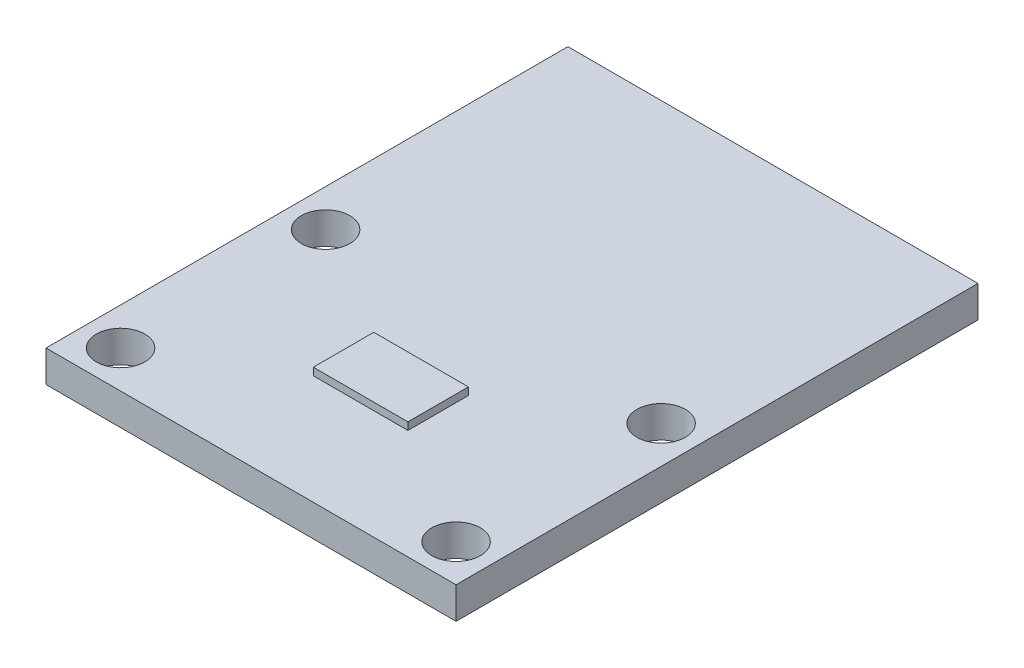
ISO-10303-21;
HEADER;
FILE_DESCRIPTION(('STEP AP214'),'2;1');
FILE_NAME('part.step','',(''),(''),'','','');
FILE_SCHEMA(('AUTOMOTIVE_DESIGN { 1 0 10303 214 1 1 1 1 }'));
ENDSEC;
DATA;
#1=APPLICATION_CONTEXT('core data for automotive mechanical design processes');
#2=APPLICATION_PROTOCOL_DEFINITION('international standard','automotive_design',2000,#1);
#3=PRODUCT_CONTEXT('',#1,'mechanical');
#4=PRODUCT('Part','Part','',(#3));
#5=PRODUCT_RELATED_PRODUCT_CATEGORY('part','',(#4));
#6=PRODUCT_DEFINITION_FORMATION('','',#4);
#7=PRODUCT_DEFINITION_CONTEXT('part definition',#1,'design');
#8=PRODUCT_DEFINITION('design','',#6,#7);
#9=PRODUCT_DEFINITION_SHAPE('','',#8);
#10=(LENGTH_UNIT() NAMED_UNIT(*) SI_UNIT(.MILLI.,.METRE.));
#11=(NAMED_UNIT(*) PLANE_ANGLE_UNIT() SI_UNIT($,.RADIAN.));
#12=(NAMED_UNIT(*) SI_UNIT($,.STERADIAN.) SOLID_ANGLE_UNIT());
#13=UNCERTAINTY_MEASURE_WITH_UNIT(LENGTH_MEASURE(1.E-05),#10,'distance_accuracy_value','');
#14=(GEOMETRIC_REPRESENTATION_CONTEXT(3) GLOBAL_UNCERTAINTY_ASSIGNED_CONTEXT((#13)) GLOBAL_UNIT_ASSIGNED_CONTEXT((#10,
#11,#12)) REPRESENTATION_CONTEXT('',''));
#15=CARTESIAN_POINT('',(0.,0.,0.));
#16=DIRECTION('',(0.,0.,1.));
#17=DIRECTION('',(1.,0.,0.));
#18=AXIS2_PLACEMENT_3D('',#15,#16,#17);
#19=CARTESIAN_POINT('',(0.,1.7,0.));
#20=DIRECTION('',(0.,-1.,0.));
#21=DIRECTION('',(0.,0.,-1.));
#22=AXIS2_PLACEMENT_3D('',#19,#20,#21);
#23=PLANE('',#22);
#24=CARTESIAN_POINT('',(-9.,1.7,12.));
#25=DIRECTION('',(0.,1.,0.));
#26=DIRECTION('',(0.,0.,1.));
#27=AXIS2_PLACEMENT_3D('',#24,#25,#26);
#28=CIRCLE('',#27,1.3);
#29=CARTESIAN_POINT('',(-9.,1.7,13.3));
#30=VERTEX_POINT('',#29);
#31=EDGE_CURVE('E126',#30,#30,#28,.T.);
#32=ORIENTED_EDGE('',*,*,#31,.F.);
#33=EDGE_LOOP('',(#32));
#34=FACE_BOUND('',#33,.T.);
#35=CARTESIAN_POINT('',(-9.,1.7,0.999999999999994));
#36=DIRECTION('',(0.,1.,0.));
#37=DIRECTION('',(0.,0.,1.));
#38=AXIS2_PLACEMENT_3D('',#35,#36,#37);
#39=CIRCLE('',#38,1.3);
#40=CARTESIAN_POINT('',(-9.,1.7,2.3));
#41=VERTEX_POINT('',#40);
#42=EDGE_CURVE('E135',#41,#41,#39,.T.);
#43=ORIENTED_EDGE('',*,*,#42,.F.);
#44=EDGE_LOOP('',(#43));
#45=FACE_BOUND('',#44,.T.);
#46=CARTESIAN_POINT('',(9.,1.7,12.));
#47=DIRECTION('',(0.,1.,0.));
#48=DIRECTION('',(0.,0.,1.));
#49=AXIS2_PLACEMENT_3D('',#46,#47,#48);
#50=CIRCLE('',#49,1.3);
#51=CARTESIAN_POINT('',(9.,1.7,13.3));
#52=VERTEX_POINT('',#51);
#53=EDGE_CURVE('E141',#52,#52,#50,.T.);
#54=ORIENTED_EDGE('',*,*,#53,.F.);
#55=EDGE_LOOP('',(#54));
#56=FACE_BOUND('',#55,.T.);
#57=CARTESIAN_POINT('',(9.,1.7,0.999999999999994));
#58=DIRECTION('',(0.,1.,0.));
#59=DIRECTION('',(0.,0.,1.));
#60=AXIS2_PLACEMENT_3D('',#57,#58,#59);
#61=CIRCLE('',#60,1.3);
#62=CARTESIAN_POINT('',(9.,1.7,2.3));
#63=VERTEX_POINT('',#62);
#64=EDGE_CURVE('E147',#63,#63,#61,.T.);
#65=ORIENTED_EDGE('',*,*,#64,.F.);
#66=EDGE_LOOP('',(#65));
#67=FACE_BOUND('',#66,.T.);
#68=DIRECTION('',(0.,0.,-1.));
#69=VECTOR('',#68,1.);
#70=CARTESIAN_POINT('',(11.,1.7,14.));
#71=LINE('',#70,#69);
#72=CARTESIAN_POINT('',(11.,1.7,14.));
#73=VERTEX_POINT('',#72);
#74=CARTESIAN_POINT('',(11.,1.7,-14.));
#75=VERTEX_POINT('',#74);
#76=EDGE_CURVE('E153',#73,#75,#71,.T.);
#77=ORIENTED_EDGE('',*,*,#76,.T.);
#78=DIRECTION('',(-1.,0.,0.));
#79=VECTOR('',#78,1.);
#80=CARTESIAN_POINT('',(-11.,1.7,-14.));
#81=LINE('',#80,#79);
#82=CARTESIAN_POINT('',(-11.,1.7,-14.));
#83=VERTEX_POINT('',#82);
#84=EDGE_CURVE('E156',#75,#83,#81,.T.);
#85=ORIENTED_EDGE('',*,*,#84,.T.);
#86=DIRECTION('',(0.,0.,1.));
#87=VECTOR('',#86,1.);
#88=CARTESIAN_POINT('',(-11.,1.7,14.));
#89=LINE('',#88,#87);
#90=CARTESIAN_POINT('',(-11.,1.7,14.));
#91=VERTEX_POINT('',#90);
#92=EDGE_CURVE('E159',#83,#91,#89,.T.);
#93=ORIENTED_EDGE('',*,*,#92,.T.);
#94=DIRECTION('',(1.,0.,0.));
#95=VECTOR('',#94,1.);
#96=CARTESIAN_POINT('',(-11.,1.7,14.));
#97=LINE('',#96,#95);
#98=EDGE_CURVE('E161',#91,#73,#97,.T.);
#99=ORIENTED_EDGE('',*,*,#98,.T.);
#100=EDGE_LOOP('',(#77,#85,#93,#99));
#101=FACE_BOUND('',#100,.T.);
#102=DIRECTION('',(0.,0.,1.));
#103=VECTOR('',#102,1.);
#104=CARTESIAN_POINT('',(-2.5382685455824,1.7,8.12245934586368));
#105=LINE('',#104,#103);
#106=CARTESIAN_POINT('',(-2.5382685455824,1.7,4.8775406541363));
#107=VERTEX_POINT('',#106);
#108=CARTESIAN_POINT('',(-2.5382685455824,1.7,8.12245934586368));
#109=VERTEX_POINT('',#108);
#110=EDGE_CURVE('E122',#107,#109,#105,.T.);
#111=ORIENTED_EDGE('',*,*,#110,.F.);
#112=DIRECTION('',(-1.,0.,0.));
#113=VECTOR('',#112,1.);
#114=CARTESIAN_POINT('',(2.5382685455824,1.7,4.8775406541363));
#115=LINE('',#114,#113);
#116=CARTESIAN_POINT('',(2.5382685455824,1.7,4.8775406541363));
#117=VERTEX_POINT('',#116);
#118=EDGE_CURVE('E119',#117,#107,#115,.T.);
#119=ORIENTED_EDGE('',*,*,#118,.F.);
#120=DIRECTION('',(0.,0.,-1.));
#121=VECTOR('',#120,1.);
#122=CARTESIAN_POINT('',(2.5382685455824,1.7,8.12245934586368));
#123=LINE('',#122,#121);
#124=CARTESIAN_POINT('',(2.5382685455824,1.7,8.12245934586368));
#125=VERTEX_POINT('',#124);
#126=EDGE_CURVE('E57',#125,#117,#123,.T.);
#127=ORIENTED_EDGE('',*,*,#126,.F.);
#128=DIRECTION('',(1.,0.,0.));
#129=VECTOR('',#128,1.);
#130=CARTESIAN_POINT('',(2.5382685455824,1.7,8.12245934586368));
#131=LINE('',#130,#129);
#132=EDGE_CURVE('E52',#109,#125,#131,.T.);
#133=ORIENTED_EDGE('',*,*,#132,.F.);
#134=EDGE_LOOP('',(#111,#119,#127,#133));
#135=FACE_BOUND('',#134,.T.);
#136=ADVANCED_FACE('F37',(#34,#45,#56,#67,#101,#135),#23,.F.);
#137=CARTESIAN_POINT('',(0.,0.,0.));
#138=DIRECTION('',(0.,-1.,0.));
#139=DIRECTION('',(0.,0.,-1.));
#140=AXIS2_PLACEMENT_3D('',#137,#138,#139);
#141=PLANE('',#140);
#142=CARTESIAN_POINT('',(-9.,0.,0.999999999999994));
#143=DIRECTION('',(0.,1.,0.));
#144=DIRECTION('',(0.,0.,1.));
#145=AXIS2_PLACEMENT_3D('',#142,#143,#144);
#146=CIRCLE('',#145,1.3);
#147=CARTESIAN_POINT('',(-9.,0.,2.3));
#148=VERTEX_POINT('',#147);
#149=EDGE_CURVE('E133',#148,#148,#146,.T.);
#150=ORIENTED_EDGE('',*,*,#149,.T.);
#151=EDGE_LOOP('',(#150));
#152=FACE_BOUND('',#151,.T.);
#153=CARTESIAN_POINT('',(9.,0.,0.999999999999994));
#154=DIRECTION('',(0.,1.,0.));
#155=DIRECTION('',(0.,0.,1.));
#156=AXIS2_PLACEMENT_3D('',#153,#154,#155);
#157=CIRCLE('',#156,1.3);
#158=CARTESIAN_POINT('',(9.,0.,2.3));
#159=VERTEX_POINT('',#158);
#160=EDGE_CURVE('E144',#159,#159,#157,.T.);
#161=ORIENTED_EDGE('',*,*,#160,.T.);
#162=EDGE_LOOP('',(#161));
#163=FACE_BOUND('',#162,.T.);
#164=DIRECTION('',(0.,0.,-1.));
#165=VECTOR('',#164,1.);
#166=CARTESIAN_POINT('',(11.,0.,14.));
#167=LINE('',#166,#165);
#168=CARTESIAN_POINT('',(11.,0.,14.));
#169=VERTEX_POINT('',#168);
#170=CARTESIAN_POINT('',(11.,0.,-14.));
#171=VERTEX_POINT('',#170);
#172=EDGE_CURVE('E150',#169,#171,#167,.T.);
#173=ORIENTED_EDGE('',*,*,#172,.F.);
#174=DIRECTION('',(1.,0.,0.));
#175=VECTOR('',#174,1.);
#176=CARTESIAN_POINT('',(-11.,0.,14.));
#177=LINE('',#176,#175);
#178=CARTESIAN_POINT('',(-11.,0.,14.));
#179=VERTEX_POINT('',#178);
#180=EDGE_CURVE('E157',#179,#169,#177,.T.);
#181=ORIENTED_EDGE('',*,*,#180,.F.);
#182=DIRECTION('',(0.,0.,1.));
#183=VECTOR('',#182,1.);
#184=CARTESIAN_POINT('',(-11.,0.,14.));
#185=LINE('',#184,#183);
#186=CARTESIAN_POINT('',(-11.,0.,-14.));
#187=VERTEX_POINT('',#186);
#188=EDGE_CURVE('E168',#187,#179,#185,.T.);
#189=ORIENTED_EDGE('',*,*,#188,.F.);
#190=DIRECTION('',(-1.,0.,0.));
#191=VECTOR('',#190,1.);
#192=CARTESIAN_POINT('',(-11.,0.,-14.));
#193=LINE('',#192,#191);
#194=EDGE_CURVE('E166',#171,#187,#193,.T.);
#195=ORIENTED_EDGE('',*,*,#194,.F.);
#196=EDGE_LOOP('',(#173,#181,#189,#195));
#197=FACE_BOUND('',#196,.T.);
#198=CARTESIAN_POINT('',(9.,0.,12.));
#199=DIRECTION('',(0.,1.,0.));
#200=DIRECTION('',(0.,0.,1.));
#201=AXIS2_PLACEMENT_3D('',#198,#199,#200);
#202=CIRCLE('',#201,1.3);
#203=CARTESIAN_POINT('',(9.,0.,13.3));
#204=VERTEX_POINT('',#203);
#205=EDGE_CURVE('E138',#204,#204,#202,.T.);
#206=ORIENTED_EDGE('',*,*,#205,.T.);
#207=EDGE_LOOP('',(#206));
#208=FACE_BOUND('',#207,.T.);
#209=CARTESIAN_POINT('',(-9.,0.,12.));
#210=DIRECTION('',(0.,1.,0.));
#211=DIRECTION('',(0.,0.,1.));
#212=AXIS2_PLACEMENT_3D('',#209,#210,#211);
#213=CIRCLE('',#212,1.3);
#214=CARTESIAN_POINT('',(-9.,0.,13.3));
#215=VERTEX_POINT('',#214);
#216=EDGE_CURVE('E123',#215,#215,#213,.T.);
#217=ORIENTED_EDGE('',*,*,#216,.T.);
#218=EDGE_LOOP('',(#217));
#219=FACE_BOUND('',#218,.T.);
#220=ADVANCED_FACE('F186',(#152,#163,#197,#208,#219),#141,.T.);
#221=CARTESIAN_POINT('',(11.,1.7,14.));
#222=DIRECTION('',(-1.,0.,0.));
#223=DIRECTION('',(0.,0.,1.));
#224=AXIS2_PLACEMENT_3D('',#221,#222,#223);
#225=PLANE('',#224);
#226=ORIENTED_EDGE('',*,*,#172,.T.);
#227=DIRECTION('',(0.,-1.,0.));
#228=VECTOR('',#227,1.);
#229=CARTESIAN_POINT('',(11.,1.7,-14.));
#230=LINE('',#229,#228);
#231=EDGE_CURVE('E11',#75,#171,#230,.T.);
#232=ORIENTED_EDGE('',*,*,#231,.F.);
#233=ORIENTED_EDGE('',*,*,#76,.F.);
#234=DIRECTION('',(0.,-1.,0.));
#235=VECTOR('',#234,1.);
#236=CARTESIAN_POINT('',(11.,1.7,14.));
#237=LINE('',#236,#235);
#238=EDGE_CURVE('E163',#73,#169,#237,.T.);
#239=ORIENTED_EDGE('',*,*,#238,.T.);
#240=EDGE_LOOP('',(#226,#232,#233,#239));
#241=FACE_BOUND('',#240,.T.);
#242=ADVANCED_FACE('F39',(#241),#225,.F.);
#243=CARTESIAN_POINT('',(-11.,1.7,-14.));
#244=DIRECTION('',(0.,0.,1.));
#245=DIRECTION('',(1.,0.,0.));
#246=AXIS2_PLACEMENT_3D('',#243,#244,#245);
#247=PLANE('',#246);
#248=ORIENTED_EDGE('',*,*,#194,.T.);
#249=DIRECTION('',(0.,-1.,0.));
#250=VECTOR('',#249,1.);
#251=CARTESIAN_POINT('',(-11.,1.7,-14.));
#252=LINE('',#251,#250);
#253=EDGE_CURVE('E45',#83,#187,#252,.T.);
#254=ORIENTED_EDGE('',*,*,#253,.F.);
#255=ORIENTED_EDGE('',*,*,#84,.F.);
#256=ORIENTED_EDGE('',*,*,#231,.T.);
#257=EDGE_LOOP('',(#248,#254,#255,#256));
#258=FACE_BOUND('',#257,.T.);
#259=ADVANCED_FACE('F196',(#258),#247,.F.);
#260=CARTESIAN_POINT('',(-11.,1.7,14.));
#261=DIRECTION('',(1.,0.,0.));
#262=DIRECTION('',(0.,0.,-1.));
#263=AXIS2_PLACEMENT_3D('',#260,#261,#262);
#264=PLANE('',#263);
#265=ORIENTED_EDGE('',*,*,#188,.T.);
#266=DIRECTION('',(0.,-1.,0.));
#267=VECTOR('',#266,1.);
#268=CARTESIAN_POINT('',(-11.,1.7,14.));
#269=LINE('',#268,#267);
#270=EDGE_CURVE('E173',#91,#179,#269,.T.);
#271=ORIENTED_EDGE('',*,*,#270,.F.);
#272=ORIENTED_EDGE('',*,*,#92,.F.);
#273=ORIENTED_EDGE('',*,*,#253,.T.);
#274=EDGE_LOOP('',(#265,#271,#272,#273));
#275=FACE_BOUND('',#274,.T.);
#276=ADVANCED_FACE('F180',(#275),#264,.F.);
#277=CARTESIAN_POINT('',(-11.,1.7,14.));
#278=DIRECTION('',(0.,0.,-1.));
#279=DIRECTION('',(-1.,0.,0.));
#280=AXIS2_PLACEMENT_3D('',#277,#278,#279);
#281=PLANE('',#280);
#282=ORIENTED_EDGE('',*,*,#180,.T.);
#283=ORIENTED_EDGE('',*,*,#238,.F.);
#284=ORIENTED_EDGE('',*,*,#98,.F.);
#285=ORIENTED_EDGE('',*,*,#270,.T.);
#286=EDGE_LOOP('',(#282,#283,#284,#285));
#287=FACE_BOUND('',#286,.T.);
#288=ADVANCED_FACE('F190',(#287),#281,.F.);
#289=CARTESIAN_POINT('',(9.,1.7,0.999999999999994));
#290=DIRECTION('',(0.,-1.,0.));
#291=DIRECTION('',(0.,0.,-1.));
#292=AXIS2_PLACEMENT_3D('',#289,#290,#291);
#293=CYLINDRICAL_SURFACE('',#292,1.3);
#294=ORIENTED_EDGE('',*,*,#64,.T.);
#295=EDGE_LOOP('',(#294));
#296=FACE_BOUND('',#295,.T.);
#297=ORIENTED_EDGE('',*,*,#160,.F.);
#298=EDGE_LOOP('',(#297));
#299=FACE_BOUND('',#298,.T.);
#300=ADVANCED_FACE('F214',(#296,#299),#293,.F.);
#301=CARTESIAN_POINT('',(9.,1.7,12.));
#302=DIRECTION('',(0.,-1.,0.));
#303=DIRECTION('',(0.,0.,-1.));
#304=AXIS2_PLACEMENT_3D('',#301,#302,#303);
#305=CYLINDRICAL_SURFACE('',#304,1.3);
#306=ORIENTED_EDGE('',*,*,#53,.T.);
#307=EDGE_LOOP('',(#306));
#308=FACE_BOUND('',#307,.T.);
#309=ORIENTED_EDGE('',*,*,#205,.F.);
#310=EDGE_LOOP('',(#309));
#311=FACE_BOUND('',#310,.T.);
#312=ADVANCED_FACE('F221',(#308,#311),#305,.F.);
#313=CARTESIAN_POINT('',(-9.,1.7,0.999999999999994));
#314=DIRECTION('',(0.,-1.,0.));
#315=DIRECTION('',(0.,0.,-1.));
#316=AXIS2_PLACEMENT_3D('',#313,#314,#315);
#317=CYLINDRICAL_SURFACE('',#316,1.3);
#318=ORIENTED_EDGE('',*,*,#42,.T.);
#319=EDGE_LOOP('',(#318));
#320=FACE_BOUND('',#319,.T.);
#321=ORIENTED_EDGE('',*,*,#149,.F.);
#322=EDGE_LOOP('',(#321));
#323=FACE_BOUND('',#322,.T.);
#324=ADVANCED_FACE('F226',(#320,#323),#317,.F.);
#325=CARTESIAN_POINT('',(-9.,1.7,12.));
#326=DIRECTION('',(0.,-1.,0.));
#327=DIRECTION('',(0.,0.,-1.));
#328=AXIS2_PLACEMENT_3D('',#325,#326,#327);
#329=CYLINDRICAL_SURFACE('',#328,1.3);
#330=ORIENTED_EDGE('',*,*,#31,.T.);
#331=EDGE_LOOP('',(#330));
#332=FACE_BOUND('',#331,.T.);
#333=ORIENTED_EDGE('',*,*,#216,.F.);
#334=EDGE_LOOP('',(#333));
#335=FACE_BOUND('',#334,.T.);
#336=ADVANCED_FACE('F236',(#332,#335),#329,.F.);
#337=CARTESIAN_POINT('',(-2.5382685455824,2.1,8.12245934586368));
#338=DIRECTION('',(1.,0.,0.));
#339=DIRECTION('',(0.,0.,-1.));
#340=AXIS2_PLACEMENT_3D('',#337,#338,#339);
#341=PLANE('',#340);
#342=ORIENTED_EDGE('',*,*,#110,.T.);
#343=DIRECTION('',(0.,-1.,0.));
#344=VECTOR('',#343,1.);
#345=CARTESIAN_POINT('',(-2.5382685455824,2.1,8.12245934586368));
#346=LINE('',#345,#344);
#347=CARTESIAN_POINT('',(-2.5382685455824,2.1,8.12245934586368));
#348=VERTEX_POINT('',#347);
#349=EDGE_CURVE('E103',#348,#109,#346,.T.);
#350=ORIENTED_EDGE('',*,*,#349,.F.);
#351=DIRECTION('',(0.,0.,1.));
#352=VECTOR('',#351,1.);
#353=CARTESIAN_POINT('',(-2.5382685455824,2.1,8.12245934586368));
#354=LINE('',#353,#352);
#355=CARTESIAN_POINT('',(-2.5382685455824,2.1,4.8775406541363));
#356=VERTEX_POINT('',#355);
#357=EDGE_CURVE('E110',#356,#348,#354,.T.);
#358=ORIENTED_EDGE('',*,*,#357,.F.);
#359=DIRECTION('',(0.,-1.,0.));
#360=VECTOR('',#359,1.);
#361=CARTESIAN_POINT('',(-2.5382685455824,2.1,4.8775406541363));
#362=LINE('',#361,#360);
#363=EDGE_CURVE('E369',#356,#107,#362,.T.);
#364=ORIENTED_EDGE('',*,*,#363,.T.);
#365=EDGE_LOOP('',(#342,#350,#358,#364));
#366=FACE_BOUND('',#365,.T.);
#367=ADVANCED_FACE('F121',(#366),#341,.F.);
#368=CARTESIAN_POINT('',(2.5382685455824,2.1,8.12245934586368));
#369=DIRECTION('',(0.,0.,-1.));
#370=DIRECTION('',(-1.,0.,0.));
#371=AXIS2_PLACEMENT_3D('',#368,#369,#370);
#372=PLANE('',#371);
#373=ORIENTED_EDGE('',*,*,#132,.T.);
#374=DIRECTION('',(0.,-1.,0.));
#375=VECTOR('',#374,1.);
#376=CARTESIAN_POINT('',(2.5382685455824,2.1,8.12245934586368));
#377=LINE('',#376,#375);
#378=CARTESIAN_POINT('',(2.5382685455824,2.1,8.12245934586368));
#379=VERTEX_POINT('',#378);
#380=EDGE_CURVE('E106',#379,#125,#377,.T.);
#381=ORIENTED_EDGE('',*,*,#380,.F.);
#382=DIRECTION('',(1.,0.,0.));
#383=VECTOR('',#382,1.);
#384=CARTESIAN_POINT('',(2.5382685455824,2.1,8.12245934586368));
#385=LINE('',#384,#383);
#386=EDGE_CURVE('E99',#348,#379,#385,.T.);
#387=ORIENTED_EDGE('',*,*,#386,.F.);
#388=ORIENTED_EDGE('',*,*,#349,.T.);
#389=EDGE_LOOP('',(#373,#381,#387,#388));
#390=FACE_BOUND('',#389,.T.);
#391=ADVANCED_FACE('F101',(#390),#372,.F.);
#392=CARTESIAN_POINT('',(2.5382685455824,2.1,8.12245934586368));
#393=DIRECTION('',(-1.,0.,0.));
#394=DIRECTION('',(0.,0.,1.));
#395=AXIS2_PLACEMENT_3D('',#392,#393,#394);
#396=PLANE('',#395);
#397=ORIENTED_EDGE('',*,*,#126,.T.);
#398=DIRECTION('',(0.,-1.,0.));
#399=VECTOR('',#398,1.);
#400=CARTESIAN_POINT('',(2.5382685455824,2.1,4.8775406541363));
#401=LINE('',#400,#399);
#402=CARTESIAN_POINT('',(2.5382685455824,2.1,4.8775406541363));
#403=VERTEX_POINT('',#402);
#404=EDGE_CURVE('E128',#403,#117,#401,.T.);
#405=ORIENTED_EDGE('',*,*,#404,.F.);
#406=DIRECTION('',(0.,0.,-1.));
#407=VECTOR('',#406,1.);
#408=CARTESIAN_POINT('',(2.5382685455824,2.1,8.12245934586368));
#409=LINE('',#408,#407);
#410=EDGE_CURVE('E109',#379,#403,#409,.T.);
#411=ORIENTED_EDGE('',*,*,#410,.F.);
#412=ORIENTED_EDGE('',*,*,#380,.T.);
#413=EDGE_LOOP('',(#397,#405,#411,#412));
#414=FACE_BOUND('',#413,.T.);
#415=ADVANCED_FACE('F248',(#414),#396,.F.);
#416=CARTESIAN_POINT('',(2.5382685455824,2.1,4.8775406541363));
#417=DIRECTION('',(0.,0.,1.));
#418=DIRECTION('',(1.,0.,0.));
#419=AXIS2_PLACEMENT_3D('',#416,#417,#418);
#420=PLANE('',#419);
#421=ORIENTED_EDGE('',*,*,#118,.T.);
#422=ORIENTED_EDGE('',*,*,#363,.F.);
#423=DIRECTION('',(-1.,0.,0.));
#424=VECTOR('',#423,1.);
#425=CARTESIAN_POINT('',(2.5382685455824,2.1,4.8775406541363));
#426=LINE('',#425,#424);
#427=EDGE_CURVE('E115',#403,#356,#426,.T.);
#428=ORIENTED_EDGE('',*,*,#427,.F.);
#429=ORIENTED_EDGE('',*,*,#404,.T.);
#430=EDGE_LOOP('',(#421,#422,#428,#429));
#431=FACE_BOUND('',#430,.T.);
#432=ADVANCED_FACE('F251',(#431),#420,.F.);
#433=CARTESIAN_POINT('',(0.,2.1,0.));
#434=DIRECTION('',(0.,1.,0.));
#435=DIRECTION('',(0.,0.,1.));
#436=AXIS2_PLACEMENT_3D('',#433,#434,#435);
#437=PLANE('',#436);
#438=ORIENTED_EDGE('',*,*,#357,.T.);
#439=ORIENTED_EDGE('',*,*,#386,.T.);
#440=ORIENTED_EDGE('',*,*,#410,.T.);
#441=ORIENTED_EDGE('',*,*,#427,.T.);
#442=EDGE_LOOP('',(#438,#439,#440,#441));
#443=FACE_BOUND('',#442,.T.);
#444=ADVANCED_FACE('F113',(#443),#437,.T.);
#445=CLOSED_SHELL('',(#136,#220,#242,#259,#276,#288,#300,#312,#324,#336,#367,#391,#415,#432,#444));
#446=MANIFOLD_SOLID_BREP('B2',#445);
#447=ADVANCED_BREP_SHAPE_REPRESENTATION('',(#18,#446),#14);
#448=SHAPE_DEFINITION_REPRESENTATION(#9,#447);
ENDSEC;
END-ISO-10303-21;
